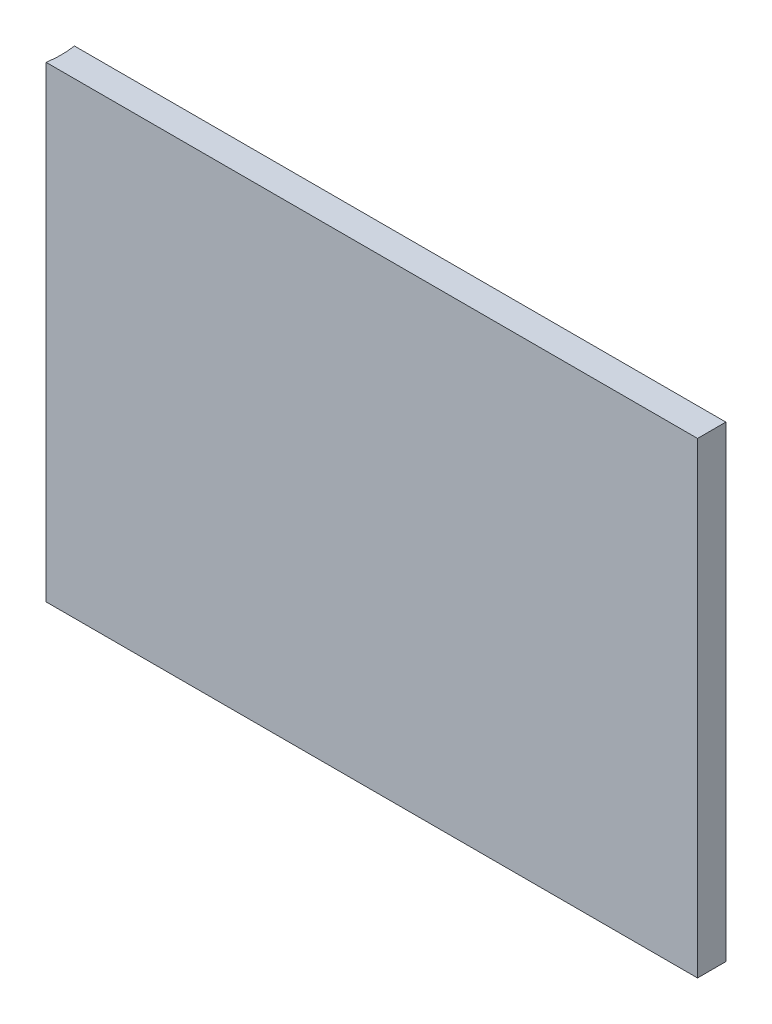
ISO-10303-21;
HEADER;
FILE_DESCRIPTION(('STEP AP214'),'2;1');
FILE_NAME('part.step','',(''),(''),'','','');
FILE_SCHEMA(('AUTOMOTIVE_DESIGN { 1 0 10303 214 1 1 1 1 }'));
ENDSEC;
DATA;
#1=APPLICATION_CONTEXT('core data for automotive mechanical design processes');
#2=APPLICATION_PROTOCOL_DEFINITION('international standard','automotive_design',2000,#1);
#3=PRODUCT_CONTEXT('',#1,'mechanical');
#4=PRODUCT('Part','Part','',(#3));
#5=PRODUCT_RELATED_PRODUCT_CATEGORY('part','',(#4));
#6=PRODUCT_DEFINITION_FORMATION('','',#4);
#7=PRODUCT_DEFINITION_CONTEXT('part definition',#1,'design');
#8=PRODUCT_DEFINITION('design','',#6,#7);
#9=PRODUCT_DEFINITION_SHAPE('','',#8);
#10=(LENGTH_UNIT() NAMED_UNIT(*) SI_UNIT(.MILLI.,.METRE.));
#11=(NAMED_UNIT(*) PLANE_ANGLE_UNIT() SI_UNIT($,.RADIAN.));
#12=(NAMED_UNIT(*) SI_UNIT($,.STERADIAN.) SOLID_ANGLE_UNIT());
#13=UNCERTAINTY_MEASURE_WITH_UNIT(LENGTH_MEASURE(1.E-05),#10,'distance_accuracy_value','');
#14=(GEOMETRIC_REPRESENTATION_CONTEXT(3) GLOBAL_UNCERTAINTY_ASSIGNED_CONTEXT((#13)) GLOBAL_UNIT_ASSIGNED_CONTEXT((#10,
#11,#12)) REPRESENTATION_CONTEXT('',''));
#15=CARTESIAN_POINT('',(0.,0.,0.));
#16=DIRECTION('',(0.,0.,1.));
#17=DIRECTION('',(1.,0.,0.));
#18=AXIS2_PLACEMENT_3D('',#15,#16,#17);
#19=CARTESIAN_POINT('',(-75.8734929078014,-47.7769946808511,6.35));
#20=DIRECTION('',(0.,1.,0.));
#21=DIRECTION('',(0.,0.,1.));
#22=AXIS2_PLACEMENT_3D('',#19,#20,#21);
#23=PLANE('',#22);
#24=DIRECTION('',(1.,0.,0.));
#25=VECTOR('',#24,1.);
#26=CARTESIAN_POINT('',(-75.8734929078014,-47.7769946808511,6.35));
#27=LINE('',#26,#25);
#28=CARTESIAN_POINT('',(-75.8734929078014,-47.7769946808511,6.35));
#29=VERTEX_POINT('',#28);
#30=CARTESIAN_POINT('',(70.1765070921986,-47.7769946808511,6.35));
#31=VERTEX_POINT('',#30);
#32=EDGE_CURVE('E113',#29,#31,#27,.T.);
#33=ORIENTED_EDGE('',*,*,#32,.F.);
#34=CARTESIAN_POINT('',(-96.3295623249695,-47.7769946808511,3.175));
#35=DIRECTION('',(0.,1.,0.));
#36=DIRECTION('',(0.,0.,1.));
#37=AXIS2_PLACEMENT_3D('',#34,#35,#36);
#38=CIRCLE('',#37,20.701);
#39=CARTESIAN_POINT('',(-75.8734929078014,-47.7769946808511,0.));
#40=VERTEX_POINT('',#39);
#41=EDGE_CURVE('E88',#29,#40,#38,.T.);
#42=ORIENTED_EDGE('',*,*,#41,.T.);
#43=DIRECTION('',(1.,0.,0.));
#44=VECTOR('',#43,1.);
#45=CARTESIAN_POINT('',(-75.8734929078014,-47.7769946808511,0.));
#46=LINE('',#45,#44);
#47=CARTESIAN_POINT('',(70.1765070921986,-47.7769946808511,0.));
#48=VERTEX_POINT('',#47);
#49=EDGE_CURVE('E98',#40,#48,#46,.T.);
#50=ORIENTED_EDGE('',*,*,#49,.T.);
#51=DIRECTION('',(0.,0.,-1.));
#52=VECTOR('',#51,1.);
#53=CARTESIAN_POINT('',(70.1765070921986,-47.7769946808511,6.35));
#54=LINE('',#53,#52);
#55=EDGE_CURVE('E11',#31,#48,#54,.T.);
#56=ORIENTED_EDGE('',*,*,#55,.F.);
#57=EDGE_LOOP('',(#33,#42,#50,#56));
#58=FACE_BOUND('',#57,.T.);
#59=ADVANCED_FACE('F39',(#58),#23,.F.);
#60=CARTESIAN_POINT('',(70.1765070921986,56.9980053191489,6.35));
#61=DIRECTION('',(-1.,0.,0.));
#62=DIRECTION('',(0.,0.,1.));
#63=AXIS2_PLACEMENT_3D('',#60,#61,#62);
#64=PLANE('',#63);
#65=DIRECTION('',(0.,1.,0.));
#66=VECTOR('',#65,1.);
#67=CARTESIAN_POINT('',(70.1765070921986,56.9980053191489,0.));
#68=LINE('',#67,#66);
#69=CARTESIAN_POINT('',(70.1765070921986,56.9980053191489,0.));
#70=VERTEX_POINT('',#69);
#71=EDGE_CURVE('E68',#48,#70,#68,.T.);
#72=ORIENTED_EDGE('',*,*,#71,.T.);
#73=DIRECTION('',(0.,0.,-1.));
#74=VECTOR('',#73,1.);
#75=CARTESIAN_POINT('',(70.1765070921986,56.9980053191489,6.35));
#76=LINE('',#75,#74);
#77=CARTESIAN_POINT('',(70.1765070921986,56.9980053191489,6.35));
#78=VERTEX_POINT('',#77);
#79=EDGE_CURVE('E48',#78,#70,#76,.T.);
#80=ORIENTED_EDGE('',*,*,#79,.F.);
#81=DIRECTION('',(0.,1.,0.));
#82=VECTOR('',#81,1.);
#83=CARTESIAN_POINT('',(70.1765070921986,56.9980053191489,6.35));
#84=LINE('',#83,#82);
#85=EDGE_CURVE('E56',#31,#78,#84,.T.);
#86=ORIENTED_EDGE('',*,*,#85,.F.);
#87=ORIENTED_EDGE('',*,*,#55,.T.);
#88=EDGE_LOOP('',(#72,#80,#86,#87));
#89=FACE_BOUND('',#88,.T.);
#90=ADVANCED_FACE('F125',(#89),#64,.F.);
#91=CARTESIAN_POINT('',(-75.8734929078014,56.9980053191489,6.35));
#92=DIRECTION('',(0.,-1.,0.));
#93=DIRECTION('',(0.,0.,-1.));
#94=AXIS2_PLACEMENT_3D('',#91,#92,#93);
#95=PLANE('',#94);
#96=DIRECTION('',(-1.,0.,0.));
#97=VECTOR('',#96,1.);
#98=CARTESIAN_POINT('',(-75.8734929078014,56.9980053191489,0.));
#99=LINE('',#98,#97);
#100=CARTESIAN_POINT('',(-75.8734929078014,56.9980053191489,0.));
#101=VERTEX_POINT('',#100);
#102=EDGE_CURVE('E91',#70,#101,#99,.T.);
#103=ORIENTED_EDGE('',*,*,#102,.T.);
#104=CARTESIAN_POINT('',(-96.3295623249695,56.9980053191489,3.175));
#105=DIRECTION('',(0.,1.,0.));
#106=DIRECTION('',(0.,0.,1.));
#107=AXIS2_PLACEMENT_3D('',#104,#105,#106);
#108=CIRCLE('',#107,20.701);
#109=CARTESIAN_POINT('',(-75.8734929078014,56.9980053191489,6.35));
#110=VERTEX_POINT('',#109);
#111=EDGE_CURVE('E75',#110,#101,#108,.T.);
#112=ORIENTED_EDGE('',*,*,#111,.F.);
#113=DIRECTION('',(-1.,0.,0.));
#114=VECTOR('',#113,1.);
#115=CARTESIAN_POINT('',(-75.8734929078014,56.9980053191489,6.35));
#116=LINE('',#115,#114);
#117=EDGE_CURVE('E106',#78,#110,#116,.T.);
#118=ORIENTED_EDGE('',*,*,#117,.F.);
#119=ORIENTED_EDGE('',*,*,#79,.T.);
#120=EDGE_LOOP('',(#103,#112,#118,#119));
#121=FACE_BOUND('',#120,.T.);
#122=ADVANCED_FACE('F92',(#121),#95,.F.);
#123=CARTESIAN_POINT('',(0.,0.,6.35));
#124=DIRECTION('',(0.,0.,1.));
#125=DIRECTION('',(1.,0.,0.));
#126=AXIS2_PLACEMENT_3D('',#123,#124,#125);
#127=PLANE('',#126);
#128=DIRECTION('',(0.,-1.,0.));
#129=VECTOR('',#128,1.);
#130=CARTESIAN_POINT('',(-75.8734929078014,56.9980053191489,6.35));
#131=LINE('',#130,#129);
#132=EDGE_CURVE('E84',#110,#29,#131,.T.);
#133=ORIENTED_EDGE('',*,*,#132,.T.);
#134=ORIENTED_EDGE('',*,*,#32,.T.);
#135=ORIENTED_EDGE('',*,*,#85,.T.);
#136=ORIENTED_EDGE('',*,*,#117,.T.);
#137=EDGE_LOOP('',(#133,#134,#135,#136));
#138=FACE_BOUND('',#137,.T.);
#139=ADVANCED_FACE('F119',(#138),#127,.T.);
#140=CARTESIAN_POINT('',(0.,0.,0.));
#141=DIRECTION('',(0.,0.,1.));
#142=DIRECTION('',(1.,0.,0.));
#143=AXIS2_PLACEMENT_3D('',#140,#141,#142);
#144=PLANE('',#143);
#145=DIRECTION('',(0.,-1.,0.));
#146=VECTOR('',#145,1.);
#147=CARTESIAN_POINT('',(-75.8734929078014,56.9980053191489,0.));
#148=LINE('',#147,#146);
#149=EDGE_CURVE('E80',#101,#40,#148,.T.);
#150=ORIENTED_EDGE('',*,*,#149,.F.);
#151=ORIENTED_EDGE('',*,*,#102,.F.);
#152=ORIENTED_EDGE('',*,*,#71,.F.);
#153=ORIENTED_EDGE('',*,*,#49,.F.);
#154=EDGE_LOOP('',(#150,#151,#152,#153));
#155=FACE_BOUND('',#154,.T.);
#156=ADVANCED_FACE('F97',(#155),#144,.F.);
#157=CARTESIAN_POINT('',(-96.3295623249695,-47.7769946808511,3.175));
#158=DIRECTION('',(0.,1.,0.));
#159=DIRECTION('',(0.,0.,1.));
#160=AXIS2_PLACEMENT_3D('',#157,#158,#159);
#161=CYLINDRICAL_SURFACE('',#160,20.701);
#162=ORIENTED_EDGE('',*,*,#111,.T.);
#163=ORIENTED_EDGE('',*,*,#149,.T.);
#164=ORIENTED_EDGE('',*,*,#41,.F.);
#165=ORIENTED_EDGE('',*,*,#132,.F.);
#166=EDGE_LOOP('',(#162,#163,#164,#165));
#167=FACE_BOUND('',#166,.T.);
#168=ADVANCED_FACE('F77',(#167),#161,.F.);
#169=CLOSED_SHELL('',(#59,#90,#122,#139,#156,#168));
#170=MANIFOLD_SOLID_BREP('B2',#169);
#171=ADVANCED_BREP_SHAPE_REPRESENTATION('',(#18,#170),#14);
#172=SHAPE_DEFINITION_REPRESENTATION(#9,#171);
ENDSEC;
END-ISO-10303-21;
